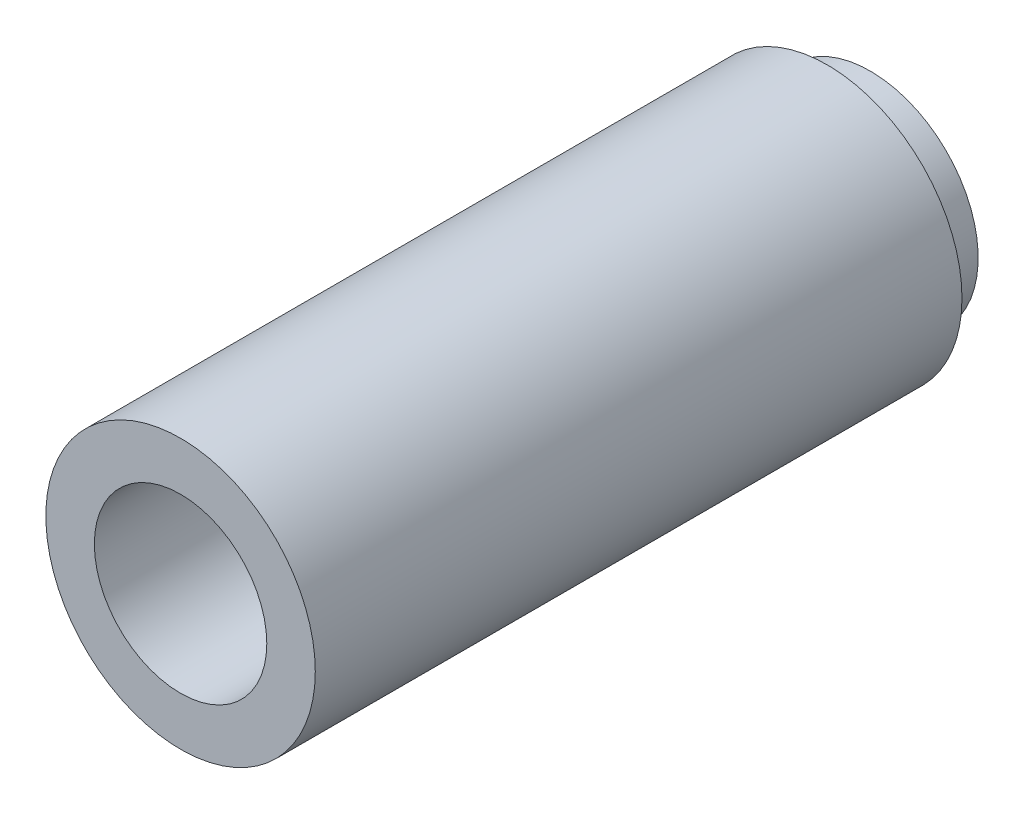
ISO-10303-21;
HEADER;
FILE_DESCRIPTION(('STEP AP214'),'2;1');
FILE_NAME('part.step','',(''),(''),'','','');
FILE_SCHEMA(('AUTOMOTIVE_DESIGN { 1 0 10303 214 1 1 1 1 }'));
ENDSEC;
DATA;
#1=APPLICATION_CONTEXT('core data for automotive mechanical design processes');
#2=APPLICATION_PROTOCOL_DEFINITION('international standard','automotive_design',2000,#1);
#3=PRODUCT_CONTEXT('',#1,'mechanical');
#4=PRODUCT('Part','Part','',(#3));
#5=PRODUCT_RELATED_PRODUCT_CATEGORY('part','',(#4));
#6=PRODUCT_DEFINITION_FORMATION('','',#4);
#7=PRODUCT_DEFINITION_CONTEXT('part definition',#1,'design');
#8=PRODUCT_DEFINITION('design','',#6,#7);
#9=PRODUCT_DEFINITION_SHAPE('','',#8);
#10=(LENGTH_UNIT() NAMED_UNIT(*) SI_UNIT(.MILLI.,.METRE.));
#11=(NAMED_UNIT(*) PLANE_ANGLE_UNIT() SI_UNIT($,.RADIAN.));
#12=(NAMED_UNIT(*) SI_UNIT($,.STERADIAN.) SOLID_ANGLE_UNIT());
#13=UNCERTAINTY_MEASURE_WITH_UNIT(LENGTH_MEASURE(1.E-05),#10,'distance_accuracy_value','');
#14=(GEOMETRIC_REPRESENTATION_CONTEXT(3) GLOBAL_UNCERTAINTY_ASSIGNED_CONTEXT((#13)) GLOBAL_UNIT_ASSIGNED_CONTEXT((#10,
#11,#12)) REPRESENTATION_CONTEXT('',''));
#15=CARTESIAN_POINT('',(0.,0.,0.));
#16=DIRECTION('',(0.,0.,1.));
#17=DIRECTION('',(1.,0.,0.));
#18=AXIS2_PLACEMENT_3D('',#15,#16,#17);
#19=CARTESIAN_POINT('',(51.75,69.5,60.));
#20=DIRECTION('',(0.,0.,-1.));
#21=DIRECTION('',(-1.,0.,0.));
#22=AXIS2_PLACEMENT_3D('',#19,#20,#21);
#23=CYLINDRICAL_SURFACE('',#22,12.5);
#24=CARTESIAN_POINT('',(51.75,69.5,60.));
#25=DIRECTION('',(0.,0.,1.));
#26=DIRECTION('',(1.,0.,0.));
#27=AXIS2_PLACEMENT_3D('',#24,#25,#26);
#28=CIRCLE('',#27,12.5);
#29=CARTESIAN_POINT('',(64.25,69.5,60.));
#30=VERTEX_POINT('',#29);
#31=EDGE_CURVE('E44',#30,#30,#28,.T.);
#32=ORIENTED_EDGE('',*,*,#31,.F.);
#33=EDGE_LOOP('',(#32));
#34=FACE_BOUND('',#33,.T.);
#35=CARTESIAN_POINT('',(51.75,69.5,0.));
#36=DIRECTION('',(0.,0.,1.));
#37=DIRECTION('',(1.,0.,0.));
#38=AXIS2_PLACEMENT_3D('',#35,#36,#37);
#39=CIRCLE('',#38,12.5);
#40=CARTESIAN_POINT('',(64.25,69.5,0.));
#41=VERTEX_POINT('',#40);
#42=EDGE_CURVE('E71',#41,#41,#39,.T.);
#43=ORIENTED_EDGE('',*,*,#42,.T.);
#44=EDGE_LOOP('',(#43));
#45=FACE_BOUND('',#44,.T.);
#46=ADVANCED_FACE('F37',(#34,#45),#23,.T.);
#47=CARTESIAN_POINT('',(51.75,69.5,60.));
#48=DIRECTION('',(0.,0.,1.));
#49=DIRECTION('',(1.,0.,0.));
#50=AXIS2_PLACEMENT_3D('',#47,#48,#49);
#51=PLANE('',#50);
#52=CARTESIAN_POINT('',(51.75,69.5,60.));
#53=DIRECTION('',(0.,0.,1.));
#54=DIRECTION('',(1.,0.,0.));
#55=AXIS2_PLACEMENT_3D('',#52,#53,#54);
#56=CIRCLE('',#55,8.);
#57=CARTESIAN_POINT('',(59.75,69.5,60.));
#58=VERTEX_POINT('',#57);
#59=EDGE_CURVE('E40',#58,#58,#56,.F.);
#60=ORIENTED_EDGE('',*,*,#59,.T.);
#61=EDGE_LOOP('',(#60));
#62=FACE_BOUND('',#61,.T.);
#63=ORIENTED_EDGE('',*,*,#31,.T.);
#64=EDGE_LOOP('',(#63));
#65=FACE_BOUND('',#64,.T.);
#66=ADVANCED_FACE('F80',(#62,#65),#51,.T.);
#67=CARTESIAN_POINT('',(51.75,69.5,0.));
#68=DIRECTION('',(0.,0.,1.));
#69=DIRECTION('',(1.,0.,0.));
#70=AXIS2_PLACEMENT_3D('',#67,#68,#69);
#71=PLANE('',#70);
#72=CARTESIAN_POINT('',(51.75,69.5,0.));
#73=DIRECTION('',(0.,0.,-1.));
#74=DIRECTION('',(-1.,0.,0.));
#75=AXIS2_PLACEMENT_3D('',#72,#73,#74);
#76=CIRCLE('',#75,10.);
#77=CARTESIAN_POINT('',(41.75,69.5,0.));
#78=VERTEX_POINT('',#77);
#79=EDGE_CURVE('E11',#78,#78,#76,.T.);
#80=ORIENTED_EDGE('',*,*,#79,.F.);
#81=EDGE_LOOP('',(#80));
#82=FACE_BOUND('',#81,.T.);
#83=ORIENTED_EDGE('',*,*,#42,.F.);
#84=EDGE_LOOP('',(#83));
#85=FACE_BOUND('',#84,.T.);
#86=ADVANCED_FACE('F77',(#82,#85),#71,.F.);
#87=CARTESIAN_POINT('',(51.75,69.5,-32.2842712474619));
#88=DIRECTION('',(0.,0.,1.));
#89=DIRECTION('',(1.,0.,0.));
#90=AXIS2_PLACEMENT_3D('',#87,#88,#89);
#91=CYLINDRICAL_SURFACE('',#90,10.);
#92=ORIENTED_EDGE('',*,*,#79,.T.);
#93=EDGE_LOOP('',(#92));
#94=FACE_BOUND('',#93,.T.);
#95=CARTESIAN_POINT('',(51.75,69.5,-4.));
#96=DIRECTION('',(0.,0.,-1.));
#97=DIRECTION('',(-1.,0.,0.));
#98=AXIS2_PLACEMENT_3D('',#95,#96,#97);
#99=CIRCLE('',#98,10.);
#100=CARTESIAN_POINT('',(41.75,69.5,-4.));
#101=VERTEX_POINT('',#100);
#102=EDGE_CURVE('E68',#101,#101,#99,.T.);
#103=ORIENTED_EDGE('',*,*,#102,.F.);
#104=EDGE_LOOP('',(#103));
#105=FACE_BOUND('',#104,.T.);
#106=ADVANCED_FACE('F79',(#94,#105),#91,.T.);
#107=CARTESIAN_POINT('',(51.75,97.5,-4.));
#108=DIRECTION('',(0.,0.,-1.));
#109=DIRECTION('',(-1.,0.,0.));
#110=AXIS2_PLACEMENT_3D('',#107,#108,#109);
#111=PLANE('',#110);
#112=CARTESIAN_POINT('',(51.75,69.5,-4.));
#113=DIRECTION('',(0.,0.,-1.));
#114=DIRECTION('',(-1.,0.,0.));
#115=AXIS2_PLACEMENT_3D('',#112,#113,#114);
#116=CIRCLE('',#115,4.99999999999999);
#117=CARTESIAN_POINT('',(46.75,69.5,-4.));
#118=VERTEX_POINT('',#117);
#119=EDGE_CURVE('E181',#118,#118,#116,.T.);
#120=ORIENTED_EDGE('',*,*,#119,.F.);
#121=EDGE_LOOP('',(#120));
#122=FACE_BOUND('',#121,.T.);
#123=ORIENTED_EDGE('',*,*,#102,.T.);
#124=EDGE_LOOP('',(#123));
#125=FACE_BOUND('',#124,.T.);
#126=ADVANCED_FACE('F86',(#122,#125),#111,.T.);
#127=CARTESIAN_POINT('',(51.75,69.5,7.37258300203048));
#128=DIRECTION('',(0.,0.,1.));
#129=DIRECTION('',(1.,0.,0.));
#130=AXIS2_PLACEMENT_3D('',#127,#128,#129);
#131=CYLINDRICAL_SURFACE('',#130,8.);
#132=ORIENTED_EDGE('',*,*,#59,.F.);
#133=EDGE_LOOP('',(#132));
#134=FACE_BOUND('',#133,.T.);
#135=CARTESIAN_POINT('',(51.75,69.5,45.));
#136=DIRECTION('',(0.,0.,1.));
#137=DIRECTION('',(1.,0.,0.));
#138=AXIS2_PLACEMENT_3D('',#135,#136,#137);
#139=CIRCLE('',#138,8.);
#140=CARTESIAN_POINT('',(59.75,69.5,45.));
#141=VERTEX_POINT('',#140);
#142=EDGE_CURVE('E58',#141,#141,#139,.T.);
#143=ORIENTED_EDGE('',*,*,#142,.F.);
#144=EDGE_LOOP('',(#143));
#145=FACE_BOUND('',#144,.T.);
#146=ADVANCED_FACE('F111',(#134,#145),#131,.F.);
#147=CARTESIAN_POINT('',(51.75,69.5,45.));
#148=DIRECTION('',(0.,0.,1.));
#149=DIRECTION('',(1.,0.,0.));
#150=AXIS2_PLACEMENT_3D('',#147,#148,#149);
#151=PLANE('',#150);
#152=ORIENTED_EDGE('',*,*,#142,.T.);
#153=EDGE_LOOP('',(#152));
#154=FACE_BOUND('',#153,.T.);
#155=ADVANCED_FACE('F52',(#154),#151,.T.);
#156=CARTESIAN_POINT('',(51.75,69.5,36.));
#157=DIRECTION('',(0.,0.,-1.));
#158=DIRECTION('',(-1.,0.,0.));
#159=AXIS2_PLACEMENT_3D('',#156,#157,#158);
#160=CONICAL_SURFACE('',#159,4.39999999999999,1.02974425867665);
#161=CARTESIAN_POINT('',(51.75,69.5,38.6437867237213));
#162=VERTEX_POINT('',#161);
#163=VERTEX_LOOP('',#162);
#164=FACE_BOUND('',#163,.T.);
#165=CARTESIAN_POINT('',(51.75,69.5,36.));
#166=DIRECTION('',(0.,0.,-1.));
#167=DIRECTION('',(-1.,0.,0.));
#168=AXIS2_PLACEMENT_3D('',#165,#166,#167);
#169=CIRCLE('',#168,4.39999999999999);
#170=CARTESIAN_POINT('',(47.35,69.5,36.));
#171=VERTEX_POINT('',#170);
#172=EDGE_CURVE('E56',#171,#171,#169,.T.);
#173=ORIENTED_EDGE('',*,*,#172,.T.);
#174=EDGE_LOOP('',(#173));
#175=FACE_BOUND('',#174,.T.);
#176=ADVANCED_FACE('F48',(#164,#175),#160,.F.);
#177=CARTESIAN_POINT('',(51.75,69.5,-4.));
#178=DIRECTION('',(0.,0.,-1.));
#179=DIRECTION('',(-1.,0.,0.));
#180=AXIS2_PLACEMENT_3D('',#177,#178,#179);
#181=CYLINDRICAL_SURFACE('',#180,4.39999999999999);
#182=ORIENTED_EDGE('',*,*,#172,.F.);
#183=EDGE_LOOP('',(#182));
#184=FACE_BOUND('',#183,.T.);
#185=CARTESIAN_POINT('',(51.75,69.5,16.));
#186=DIRECTION('',(0.,0.,-1.));
#187=DIRECTION('',(-1.,0.,0.));
#188=AXIS2_PLACEMENT_3D('',#185,#186,#187);
#189=CIRCLE('',#188,4.39999999999999);
#190=CARTESIAN_POINT('',(47.35,69.5,16.));
#191=VERTEX_POINT('',#190);
#192=EDGE_CURVE('E59',#191,#191,#189,.T.);
#193=ORIENTED_EDGE('',*,*,#192,.T.);
#194=EDGE_LOOP('',(#193));
#195=FACE_BOUND('',#194,.T.);
#196=ADVANCED_FACE('F51',(#184,#195),#181,.F.);
#197=CARTESIAN_POINT('',(56.15,69.5,16.));
#198=DIRECTION('',(0.,0.,1.));
#199=DIRECTION('',(1.,0.,0.));
#200=AXIS2_PLACEMENT_3D('',#197,#198,#199);
#201=PLANE('',#200);
#202=ORIENTED_EDGE('',*,*,#192,.F.);
#203=EDGE_LOOP('',(#202));
#204=FACE_BOUND('',#203,.T.);
#205=CARTESIAN_POINT('',(51.75,69.5,16.));
#206=DIRECTION('',(0.,0.,-1.));
#207=DIRECTION('',(-1.,0.,0.));
#208=AXIS2_PLACEMENT_3D('',#205,#206,#207);
#209=CIRCLE('',#208,5.);
#210=CARTESIAN_POINT('',(46.75,69.5,16.));
#211=VERTEX_POINT('',#210);
#212=EDGE_CURVE('E64',#211,#211,#209,.T.);
#213=ORIENTED_EDGE('',*,*,#212,.T.);
#214=EDGE_LOOP('',(#213));
#215=FACE_BOUND('',#214,.T.);
#216=ADVANCED_FACE('F151',(#204,#215),#201,.F.);
#217=CARTESIAN_POINT('',(51.75,69.5,-4.));
#218=DIRECTION('',(0.,0.,-1.));
#219=DIRECTION('',(-1.,0.,0.));
#220=AXIS2_PLACEMENT_3D('',#217,#218,#219);
#221=CYLINDRICAL_SURFACE('',#220,4.99999999999999);
#222=ORIENTED_EDGE('',*,*,#212,.F.);
#223=EDGE_LOOP('',(#222));
#224=FACE_BOUND('',#223,.T.);
#225=ORIENTED_EDGE('',*,*,#119,.T.);
#226=EDGE_LOOP('',(#225));
#227=FACE_BOUND('',#226,.T.);
#228=ADVANCED_FACE('F161',(#224,#227),#221,.F.);
#229=CLOSED_SHELL('',(#46,#66,#86,#106,#126,#146,#155,#176,#196,#216,#228));
#230=MANIFOLD_SOLID_BREP('B2',#229);
#231=ADVANCED_BREP_SHAPE_REPRESENTATION('',(#18,#230),#14);
#232=SHAPE_DEFINITION_REPRESENTATION(#9,#231);
ENDSEC;
END-ISO-10303-21;
